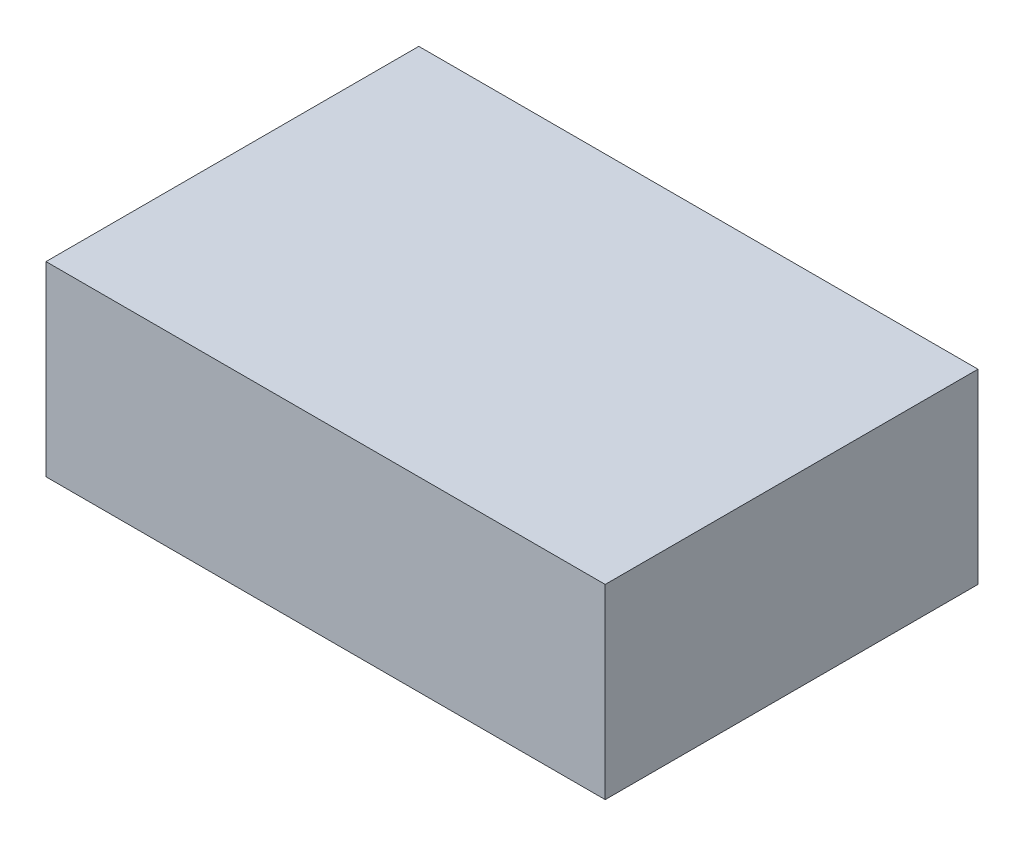
ISO-10303-21;
HEADER;
FILE_DESCRIPTION(('STEP AP214'),'2;1');
FILE_NAME('part.step','',(''),(''),'','','');
FILE_SCHEMA(('AUTOMOTIVE_DESIGN { 1 0 10303 214 1 1 1 1 }'));
ENDSEC;
DATA;
#1=APPLICATION_CONTEXT('core data for automotive mechanical design processes');
#2=APPLICATION_PROTOCOL_DEFINITION('international standard','automotive_design',2000,#1);
#3=PRODUCT_CONTEXT('',#1,'mechanical');
#4=PRODUCT('Part','Part','',(#3));
#5=PRODUCT_RELATED_PRODUCT_CATEGORY('part','',(#4));
#6=PRODUCT_DEFINITION_FORMATION('','',#4);
#7=PRODUCT_DEFINITION_CONTEXT('part definition',#1,'design');
#8=PRODUCT_DEFINITION('design','',#6,#7);
#9=PRODUCT_DEFINITION_SHAPE('','',#8);
#10=(LENGTH_UNIT() NAMED_UNIT(*) SI_UNIT(.MILLI.,.METRE.));
#11=(NAMED_UNIT(*) PLANE_ANGLE_UNIT() SI_UNIT($,.RADIAN.));
#12=(NAMED_UNIT(*) SI_UNIT($,.STERADIAN.) SOLID_ANGLE_UNIT());
#13=UNCERTAINTY_MEASURE_WITH_UNIT(LENGTH_MEASURE(1.E-05),#10,'distance_accuracy_value','');
#14=(GEOMETRIC_REPRESENTATION_CONTEXT(3) GLOBAL_UNCERTAINTY_ASSIGNED_CONTEXT((#13)) GLOBAL_UNIT_ASSIGNED_CONTEXT((#10,
#11,#12)) REPRESENTATION_CONTEXT('',''));
#15=CARTESIAN_POINT('',(0.,0.,0.));
#16=DIRECTION('',(0.,0.,1.));
#17=DIRECTION('',(1.,0.,0.));
#18=AXIS2_PLACEMENT_3D('',#15,#16,#17);
#19=CARTESIAN_POINT('',(0.6,0.4,-0.4));
#20=DIRECTION('',(-1.,0.,0.));
#21=DIRECTION('',(0.,0.,1.));
#22=AXIS2_PLACEMENT_3D('',#19,#20,#21);
#23=PLANE('',#22);
#24=DIRECTION('',(0.,0.,-1.));
#25=VECTOR('',#24,1.);
#26=CARTESIAN_POINT('',(0.6,0.,-0.4));
#27=LINE('',#26,#25);
#28=CARTESIAN_POINT('',(0.6,0.,0.4));
#29=VERTEX_POINT('',#28);
#30=CARTESIAN_POINT('',(0.6,0.,-0.4));
#31=VERTEX_POINT('',#30);
#32=EDGE_CURVE('E99',#29,#31,#27,.T.);
#33=ORIENTED_EDGE('',*,*,#32,.T.);
#34=DIRECTION('',(0.,-1.,0.));
#35=VECTOR('',#34,1.);
#36=CARTESIAN_POINT('',(0.6,0.4,-0.4));
#37=LINE('',#36,#35);
#38=CARTESIAN_POINT('',(0.6,0.4,-0.4));
#39=VERTEX_POINT('',#38);
#40=EDGE_CURVE('E11',#39,#31,#37,.T.);
#41=ORIENTED_EDGE('',*,*,#40,.F.);
#42=DIRECTION('',(0.,0.,-1.));
#43=VECTOR('',#42,1.);
#44=CARTESIAN_POINT('',(0.6,0.4,-0.4));
#45=LINE('',#44,#43);
#46=CARTESIAN_POINT('',(0.6,0.4,0.4));
#47=VERTEX_POINT('',#46);
#48=EDGE_CURVE('E87',#47,#39,#45,.T.);
#49=ORIENTED_EDGE('',*,*,#48,.F.);
#50=DIRECTION('',(0.,-1.,0.));
#51=VECTOR('',#50,1.);
#52=CARTESIAN_POINT('',(0.6,0.4,0.4));
#53=LINE('',#52,#51);
#54=EDGE_CURVE('E95',#47,#29,#53,.T.);
#55=ORIENTED_EDGE('',*,*,#54,.T.);
#56=EDGE_LOOP('',(#33,#41,#49,#55));
#57=FACE_BOUND('',#56,.T.);
#58=ADVANCED_FACE('F36',(#57),#23,.F.);
#59=CARTESIAN_POINT('',(-0.6,0.4,-0.4));
#60=DIRECTION('',(0.,0.,1.));
#61=DIRECTION('',(1.,0.,0.));
#62=AXIS2_PLACEMENT_3D('',#59,#60,#61);
#63=PLANE('',#62);
#64=DIRECTION('',(-1.,0.,0.));
#65=VECTOR('',#64,1.);
#66=CARTESIAN_POINT('',(-0.6,0.,-0.4));
#67=LINE('',#66,#65);
#68=CARTESIAN_POINT('',(-0.6,0.,-0.4));
#69=VERTEX_POINT('',#68);
#70=EDGE_CURVE('E91',#31,#69,#67,.T.);
#71=ORIENTED_EDGE('',*,*,#70,.T.);
#72=DIRECTION('',(0.,-1.,0.));
#73=VECTOR('',#72,1.);
#74=CARTESIAN_POINT('',(-0.6,0.4,-0.4));
#75=LINE('',#74,#73);
#76=CARTESIAN_POINT('',(-0.6,0.4,-0.4));
#77=VERTEX_POINT('',#76);
#78=EDGE_CURVE('E44',#77,#69,#75,.T.);
#79=ORIENTED_EDGE('',*,*,#78,.F.);
#80=DIRECTION('',(-1.,0.,0.));
#81=VECTOR('',#80,1.);
#82=CARTESIAN_POINT('',(-0.6,0.4,-0.4));
#83=LINE('',#82,#81);
#84=EDGE_CURVE('E82',#39,#77,#83,.T.);
#85=ORIENTED_EDGE('',*,*,#84,.F.);
#86=ORIENTED_EDGE('',*,*,#40,.T.);
#87=EDGE_LOOP('',(#71,#79,#85,#86));
#88=FACE_BOUND('',#87,.T.);
#89=ADVANCED_FACE('F90',(#88),#63,.F.);
#90=CARTESIAN_POINT('',(-0.6,0.4,-0.4));
#91=DIRECTION('',(1.,0.,0.));
#92=DIRECTION('',(0.,0.,-1.));
#93=AXIS2_PLACEMENT_3D('',#90,#91,#92);
#94=PLANE('',#93);
#95=DIRECTION('',(0.,0.,1.));
#96=VECTOR('',#95,1.);
#97=CARTESIAN_POINT('',(-0.6,0.,-0.4));
#98=LINE('',#97,#96);
#99=CARTESIAN_POINT('',(-0.6,0.,0.4));
#100=VERTEX_POINT('',#99);
#101=EDGE_CURVE('E69',#69,#100,#98,.T.);
#102=ORIENTED_EDGE('',*,*,#101,.T.);
#103=DIRECTION('',(0.,-1.,0.));
#104=VECTOR('',#103,1.);
#105=CARTESIAN_POINT('',(-0.6,0.4,0.4));
#106=LINE('',#105,#104);
#107=CARTESIAN_POINT('',(-0.6,0.4,0.4));
#108=VERTEX_POINT('',#107);
#109=EDGE_CURVE('E92',#108,#100,#106,.T.);
#110=ORIENTED_EDGE('',*,*,#109,.F.);
#111=DIRECTION('',(0.,0.,1.));
#112=VECTOR('',#111,1.);
#113=CARTESIAN_POINT('',(-0.6,0.4,-0.4));
#114=LINE('',#113,#112);
#115=EDGE_CURVE('E85',#77,#108,#114,.T.);
#116=ORIENTED_EDGE('',*,*,#115,.F.);
#117=ORIENTED_EDGE('',*,*,#78,.T.);
#118=EDGE_LOOP('',(#102,#110,#116,#117));
#119=FACE_BOUND('',#118,.T.);
#120=ADVANCED_FACE('F93',(#119),#94,.F.);
#121=CARTESIAN_POINT('',(-0.6,0.4,0.4));
#122=DIRECTION('',(0.,0.,-1.));
#123=DIRECTION('',(-1.,0.,0.));
#124=AXIS2_PLACEMENT_3D('',#121,#122,#123);
#125=PLANE('',#124);
#126=DIRECTION('',(1.,0.,0.));
#127=VECTOR('',#126,1.);
#128=CARTESIAN_POINT('',(-0.6,0.,0.4));
#129=LINE('',#128,#127);
#130=EDGE_CURVE('E75',#100,#29,#129,.T.);
#131=ORIENTED_EDGE('',*,*,#130,.T.);
#132=ORIENTED_EDGE('',*,*,#54,.F.);
#133=DIRECTION('',(1.,0.,0.));
#134=VECTOR('',#133,1.);
#135=CARTESIAN_POINT('',(-0.6,0.4,0.4));
#136=LINE('',#135,#134);
#137=EDGE_CURVE('E52',#108,#47,#136,.T.);
#138=ORIENTED_EDGE('',*,*,#137,.F.);
#139=ORIENTED_EDGE('',*,*,#109,.T.);
#140=EDGE_LOOP('',(#131,#132,#138,#139));
#141=FACE_BOUND('',#140,.T.);
#142=ADVANCED_FACE('F106',(#141),#125,.F.);
#143=CARTESIAN_POINT('',(0.,0.4,0.));
#144=DIRECTION('',(0.,1.,0.));
#145=DIRECTION('',(0.,0.,1.));
#146=AXIS2_PLACEMENT_3D('',#143,#144,#145);
#147=PLANE('',#146);
#148=ORIENTED_EDGE('',*,*,#48,.T.);
#149=ORIENTED_EDGE('',*,*,#84,.T.);
#150=ORIENTED_EDGE('',*,*,#115,.T.);
#151=ORIENTED_EDGE('',*,*,#137,.T.);
#152=EDGE_LOOP('',(#148,#149,#150,#151));
#153=FACE_BOUND('',#152,.T.);
#154=ADVANCED_FACE('F83',(#153),#147,.T.);
#155=CARTESIAN_POINT('',(0.,0.,0.));
#156=DIRECTION('',(0.,1.,0.));
#157=DIRECTION('',(0.,0.,1.));
#158=AXIS2_PLACEMENT_3D('',#155,#156,#157);
#159=PLANE('',#158);
#160=ORIENTED_EDGE('',*,*,#32,.F.);
#161=ORIENTED_EDGE('',*,*,#130,.F.);
#162=ORIENTED_EDGE('',*,*,#101,.F.);
#163=ORIENTED_EDGE('',*,*,#70,.F.);
#164=EDGE_LOOP('',(#160,#161,#162,#163));
#165=FACE_BOUND('',#164,.T.);
#166=ADVANCED_FACE('F109',(#165),#159,.F.);
#167=CLOSED_SHELL('',(#58,#89,#120,#142,#154,#166));
#168=MANIFOLD_SOLID_BREP('B2',#167);
#169=ADVANCED_BREP_SHAPE_REPRESENTATION('',(#18,#168),#14);
#170=SHAPE_DEFINITION_REPRESENTATION(#9,#169);
ENDSEC;
END-ISO-10303-21;
